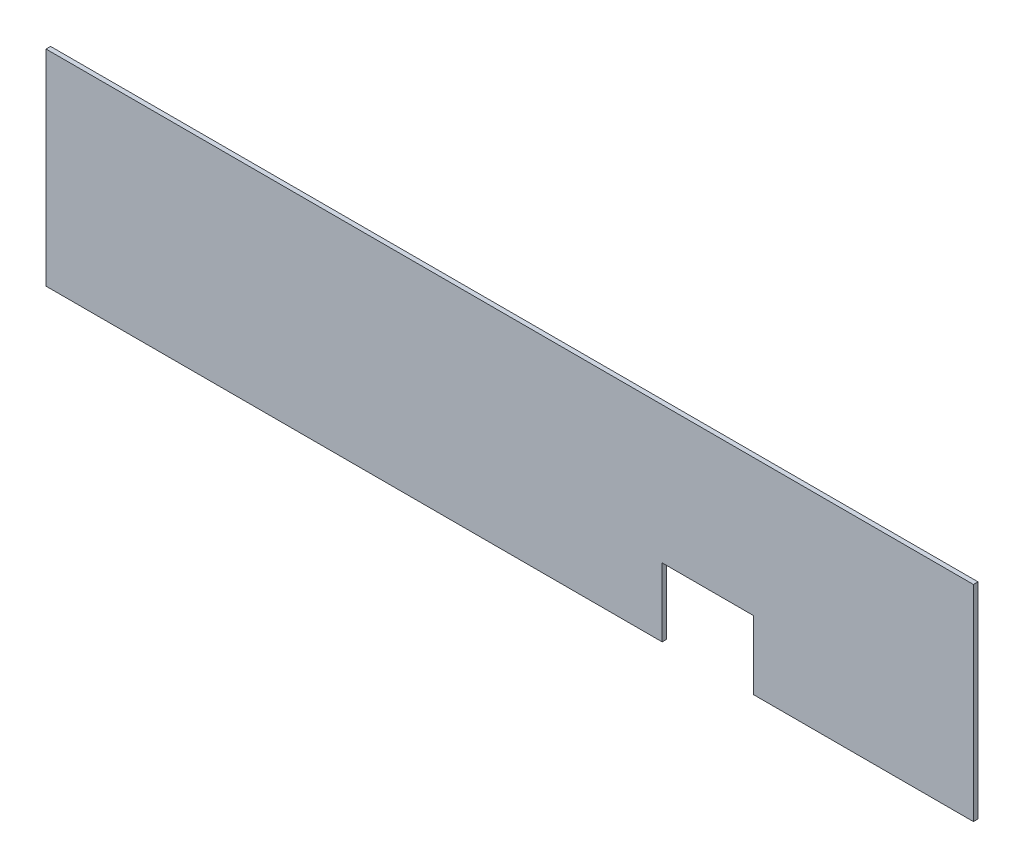
ISO-10303-21;
HEADER;
FILE_DESCRIPTION(('STEP AP214'),'2;1');
FILE_NAME('part.step','',(''),(''),'','','');
FILE_SCHEMA(('AUTOMOTIVE_DESIGN { 1 0 10303 214 1 1 1 1 }'));
ENDSEC;
DATA;
#1=APPLICATION_CONTEXT('core data for automotive mechanical design processes');
#2=APPLICATION_PROTOCOL_DEFINITION('international standard','automotive_design',2000,#1);
#3=PRODUCT_CONTEXT('',#1,'mechanical');
#4=PRODUCT('Part','Part','',(#3));
#5=PRODUCT_RELATED_PRODUCT_CATEGORY('part','',(#4));
#6=PRODUCT_DEFINITION_FORMATION('','',#4);
#7=PRODUCT_DEFINITION_CONTEXT('part definition',#1,'design');
#8=PRODUCT_DEFINITION('design','',#6,#7);
#9=PRODUCT_DEFINITION_SHAPE('','',#8);
#10=(LENGTH_UNIT() NAMED_UNIT(*) SI_UNIT(.MILLI.,.METRE.));
#11=(NAMED_UNIT(*) PLANE_ANGLE_UNIT() SI_UNIT($,.RADIAN.));
#12=(NAMED_UNIT(*) SI_UNIT($,.STERADIAN.) SOLID_ANGLE_UNIT());
#13=UNCERTAINTY_MEASURE_WITH_UNIT(LENGTH_MEASURE(1.E-05),#10,'distance_accuracy_value','');
#14=(GEOMETRIC_REPRESENTATION_CONTEXT(3) GLOBAL_UNCERTAINTY_ASSIGNED_CONTEXT((#13)) GLOBAL_UNIT_ASSIGNED_CONTEXT((#10,
#11,#12)) REPRESENTATION_CONTEXT('',''));
#15=CARTESIAN_POINT('',(0.,0.,0.));
#16=DIRECTION('',(0.,0.,1.));
#17=DIRECTION('',(1.,0.,0.));
#18=AXIS2_PLACEMENT_3D('',#15,#16,#17);
#19=CARTESIAN_POINT('',(101.6,-22.5,1.));
#20=DIRECTION('',(0.,1.,0.));
#21=DIRECTION('',(-1.,0.,0.));
#22=AXIS2_PLACEMENT_3D('',#19,#20,#21);
#23=PLANE('',#22);
#24=DIRECTION('',(1.,0.,0.));
#25=VECTOR('',#24,1.);
#26=CARTESIAN_POINT('',(101.6,-22.5,0.));
#27=LINE('',#26,#25);
#28=CARTESIAN_POINT('',(-101.6,-22.5,0.));
#29=VERTEX_POINT('',#28);
#30=CARTESIAN_POINT('',(33.4,-22.5,0.));
#31=VERTEX_POINT('',#30);
#32=EDGE_CURVE('E130',#29,#31,#27,.T.);
#33=ORIENTED_EDGE('',*,*,#32,.T.);
#34=DIRECTION('',(0.,0.,1.));
#35=VECTOR('',#34,1.);
#36=CARTESIAN_POINT('',(33.4,-22.5,0.));
#37=LINE('',#36,#35);
#38=CARTESIAN_POINT('',(33.4,-22.5,1.));
#39=VERTEX_POINT('',#38);
#40=EDGE_CURVE('E135',#31,#39,#37,.T.);
#41=ORIENTED_EDGE('',*,*,#40,.T.);
#42=DIRECTION('',(1.,0.,0.));
#43=VECTOR('',#42,1.);
#44=CARTESIAN_POINT('',(101.6,-22.5,1.));
#45=LINE('',#44,#43);
#46=CARTESIAN_POINT('',(-101.6,-22.5,1.));
#47=VERTEX_POINT('',#46);
#48=EDGE_CURVE('E85',#47,#39,#45,.T.);
#49=ORIENTED_EDGE('',*,*,#48,.F.);
#50=DIRECTION('',(0.,0.,-1.));
#51=VECTOR('',#50,1.);
#52=CARTESIAN_POINT('',(-101.6,-22.5,1.));
#53=LINE('',#52,#51);
#54=EDGE_CURVE('E11',#47,#29,#53,.T.);
#55=ORIENTED_EDGE('',*,*,#54,.T.);
#56=EDGE_LOOP('',(#33,#41,#49,#55));
#57=FACE_BOUND('',#56,.T.);
#58=ADVANCED_FACE('F33',(#57),#23,.F.);
#59=CARTESIAN_POINT('',(-101.6,-22.5,1.));
#60=DIRECTION('',(1.,0.,0.));
#61=DIRECTION('',(0.,0.,-1.));
#62=AXIS2_PLACEMENT_3D('',#59,#60,#61);
#63=PLANE('',#62);
#64=DIRECTION('',(0.,-1.,0.));
#65=VECTOR('',#64,1.);
#66=CARTESIAN_POINT('',(-101.6,-22.5,0.));
#67=LINE('',#66,#65);
#68=CARTESIAN_POINT('',(-101.6,22.5,0.));
#69=VERTEX_POINT('',#68);
#70=EDGE_CURVE('E131',#69,#29,#67,.T.);
#71=ORIENTED_EDGE('',*,*,#70,.T.);
#72=ORIENTED_EDGE('',*,*,#54,.F.);
#73=DIRECTION('',(0.,-1.,0.));
#74=VECTOR('',#73,1.);
#75=CARTESIAN_POINT('',(-101.6,-22.5,1.));
#76=LINE('',#75,#74);
#77=CARTESIAN_POINT('',(-101.6,22.5,1.));
#78=VERTEX_POINT('',#77);
#79=EDGE_CURVE('E141',#78,#47,#76,.T.);
#80=ORIENTED_EDGE('',*,*,#79,.F.);
#81=DIRECTION('',(0.,0.,-1.));
#82=VECTOR('',#81,1.);
#83=CARTESIAN_POINT('',(-101.6,22.5,1.));
#84=LINE('',#83,#82);
#85=EDGE_CURVE('E142',#78,#69,#84,.T.);
#86=ORIENTED_EDGE('',*,*,#85,.T.);
#87=EDGE_LOOP('',(#71,#72,#80,#86));
#88=FACE_BOUND('',#87,.T.);
#89=ADVANCED_FACE('F35',(#88),#63,.F.);
#90=CARTESIAN_POINT('',(53.4,-22.5,1.));
#91=VERTEX_POINT('',#90);
#92=CARTESIAN_POINT('',(101.6,-22.5,1.));
#93=VERTEX_POINT('',#92);
#94=EDGE_CURVE('E124',#91,#93,#45,.T.);
#95=ORIENTED_EDGE('',*,*,#94,.F.);
#96=DIRECTION('',(0.,0.,1.));
#97=VECTOR('',#96,1.);
#98=CARTESIAN_POINT('',(53.4,-22.5,0.));
#99=LINE('',#98,#97);
#100=CARTESIAN_POINT('',(53.4,-22.5,0.));
#101=VERTEX_POINT('',#100);
#102=EDGE_CURVE('E111',#101,#91,#99,.T.);
#103=ORIENTED_EDGE('',*,*,#102,.F.);
#104=CARTESIAN_POINT('',(101.6,-22.5,0.));
#105=VERTEX_POINT('',#104);
#106=EDGE_CURVE('E122',#101,#105,#27,.T.);
#107=ORIENTED_EDGE('',*,*,#106,.T.);
#108=DIRECTION('',(0.,0.,-1.));
#109=VECTOR('',#108,1.);
#110=CARTESIAN_POINT('',(101.6,-22.5,1.));
#111=LINE('',#110,#109);
#112=EDGE_CURVE('E41',#93,#105,#111,.T.);
#113=ORIENTED_EDGE('',*,*,#112,.F.);
#114=EDGE_LOOP('',(#95,#103,#107,#113));
#115=FACE_BOUND('',#114,.T.);
#116=ADVANCED_FACE('F120',(#115),#23,.F.);
#117=CARTESIAN_POINT('',(101.6,-22.5,1.));
#118=DIRECTION('',(-1.,0.,0.));
#119=DIRECTION('',(0.,0.,1.));
#120=AXIS2_PLACEMENT_3D('',#117,#118,#119);
#121=PLANE('',#120);
#122=DIRECTION('',(0.,1.,0.));
#123=VECTOR('',#122,1.);
#124=CARTESIAN_POINT('',(101.6,-22.5,0.));
#125=LINE('',#124,#123);
#126=CARTESIAN_POINT('',(101.6,22.5,0.));
#127=VERTEX_POINT('',#126);
#128=EDGE_CURVE('E129',#105,#127,#125,.T.);
#129=ORIENTED_EDGE('',*,*,#128,.T.);
#130=DIRECTION('',(0.,0.,-1.));
#131=VECTOR('',#130,1.);
#132=CARTESIAN_POINT('',(101.6,22.5,1.));
#133=LINE('',#132,#131);
#134=CARTESIAN_POINT('',(101.6,22.5,1.));
#135=VERTEX_POINT('',#134);
#136=EDGE_CURVE('E144',#135,#127,#133,.T.);
#137=ORIENTED_EDGE('',*,*,#136,.F.);
#138=DIRECTION('',(0.,1.,0.));
#139=VECTOR('',#138,1.);
#140=CARTESIAN_POINT('',(101.6,-22.5,1.));
#141=LINE('',#140,#139);
#142=EDGE_CURVE('E149',#93,#135,#141,.T.);
#143=ORIENTED_EDGE('',*,*,#142,.F.);
#144=ORIENTED_EDGE('',*,*,#112,.T.);
#145=EDGE_LOOP('',(#129,#137,#143,#144));
#146=FACE_BOUND('',#145,.T.);
#147=ADVANCED_FACE('F147',(#146),#121,.F.);
#148=CARTESIAN_POINT('',(101.6,22.5,1.));
#149=DIRECTION('',(0.,-1.,0.));
#150=DIRECTION('',(1.,0.,0.));
#151=AXIS2_PLACEMENT_3D('',#148,#149,#150);
#152=PLANE('',#151);
#153=DIRECTION('',(-1.,0.,0.));
#154=VECTOR('',#153,1.);
#155=CARTESIAN_POINT('',(101.6,22.5,0.));
#156=LINE('',#155,#154);
#157=EDGE_CURVE('E78',#127,#69,#156,.T.);
#158=ORIENTED_EDGE('',*,*,#157,.T.);
#159=ORIENTED_EDGE('',*,*,#85,.F.);
#160=DIRECTION('',(-1.,0.,0.));
#161=VECTOR('',#160,1.);
#162=CARTESIAN_POINT('',(101.6,22.5,1.));
#163=LINE('',#162,#161);
#164=EDGE_CURVE('E57',#135,#78,#163,.T.);
#165=ORIENTED_EDGE('',*,*,#164,.F.);
#166=ORIENTED_EDGE('',*,*,#136,.T.);
#167=EDGE_LOOP('',(#158,#159,#165,#166));
#168=FACE_BOUND('',#167,.T.);
#169=ADVANCED_FACE('F172',(#168),#152,.F.);
#170=CARTESIAN_POINT('',(0.,0.,1.));
#171=DIRECTION('',(0.,0.,1.));
#172=DIRECTION('',(1.,0.,0.));
#173=AXIS2_PLACEMENT_3D('',#170,#171,#172);
#174=PLANE('',#173);
#175=DIRECTION('',(0.,-1.,0.));
#176=VECTOR('',#175,1.);
#177=CARTESIAN_POINT('',(33.4,-22.5,1.));
#178=LINE('',#177,#176);
#179=CARTESIAN_POINT('',(33.4,-7.50000000000002,1.));
#180=VERTEX_POINT('',#179);
#181=EDGE_CURVE('E116',#180,#39,#178,.T.);
#182=ORIENTED_EDGE('',*,*,#181,.F.);
#183=DIRECTION('',(-1.,0.,0.));
#184=VECTOR('',#183,1.);
#185=CARTESIAN_POINT('',(33.4,-7.50000000000002,1.));
#186=LINE('',#185,#184);
#187=CARTESIAN_POINT('',(53.4,-7.50000000000002,1.));
#188=VERTEX_POINT('',#187);
#189=EDGE_CURVE('E159',#188,#180,#186,.T.);
#190=ORIENTED_EDGE('',*,*,#189,.F.);
#191=DIRECTION('',(0.,1.,0.));
#192=VECTOR('',#191,1.);
#193=CARTESIAN_POINT('',(53.4,-7.50000000000002,1.));
#194=LINE('',#193,#192);
#195=EDGE_CURVE('E162',#91,#188,#194,.T.);
#196=ORIENTED_EDGE('',*,*,#195,.F.);
#197=ORIENTED_EDGE('',*,*,#94,.T.);
#198=ORIENTED_EDGE('',*,*,#142,.T.);
#199=ORIENTED_EDGE('',*,*,#164,.T.);
#200=ORIENTED_EDGE('',*,*,#79,.T.);
#201=ORIENTED_EDGE('',*,*,#48,.T.);
#202=EDGE_LOOP('',(#182,#190,#196,#197,#198,#199,#200,#201));
#203=FACE_BOUND('',#202,.T.);
#204=ADVANCED_FACE('F174',(#203),#174,.T.);
#205=CARTESIAN_POINT('',(0.,0.,0.));
#206=DIRECTION('',(0.,0.,1.));
#207=DIRECTION('',(1.,0.,0.));
#208=AXIS2_PLACEMENT_3D('',#205,#206,#207);
#209=PLANE('',#208);
#210=DIRECTION('',(-1.,0.,0.));
#211=VECTOR('',#210,1.);
#212=CARTESIAN_POINT('',(33.4,-7.50000000000002,0.));
#213=LINE('',#212,#211);
#214=CARTESIAN_POINT('',(53.4,-7.50000000000002,0.));
#215=VERTEX_POINT('',#214);
#216=CARTESIAN_POINT('',(33.4,-7.50000000000002,0.));
#217=VERTEX_POINT('',#216);
#218=EDGE_CURVE('E48',#215,#217,#213,.T.);
#219=ORIENTED_EDGE('',*,*,#218,.T.);
#220=DIRECTION('',(0.,-1.,0.));
#221=VECTOR('',#220,1.);
#222=CARTESIAN_POINT('',(33.4,-22.5,0.));
#223=LINE('',#222,#221);
#224=EDGE_CURVE('E125',#217,#31,#223,.T.);
#225=ORIENTED_EDGE('',*,*,#224,.T.);
#226=ORIENTED_EDGE('',*,*,#32,.F.);
#227=ORIENTED_EDGE('',*,*,#70,.F.);
#228=ORIENTED_EDGE('',*,*,#157,.F.);
#229=ORIENTED_EDGE('',*,*,#128,.F.);
#230=ORIENTED_EDGE('',*,*,#106,.F.);
#231=DIRECTION('',(0.,1.,0.));
#232=VECTOR('',#231,1.);
#233=CARTESIAN_POINT('',(53.4,-7.50000000000002,0.));
#234=LINE('',#233,#232);
#235=EDGE_CURVE('E107',#101,#215,#234,.T.);
#236=ORIENTED_EDGE('',*,*,#235,.T.);
#237=EDGE_LOOP('',(#219,#225,#226,#227,#228,#229,#230,#236));
#238=FACE_BOUND('',#237,.T.);
#239=ADVANCED_FACE('F128',(#238),#209,.F.);
#240=CARTESIAN_POINT('',(33.4,-22.5,0.));
#241=DIRECTION('',(-1.,0.,0.));
#242=DIRECTION('',(0.,0.,1.));
#243=AXIS2_PLACEMENT_3D('',#240,#241,#242);
#244=PLANE('',#243);
#245=ORIENTED_EDGE('',*,*,#181,.T.);
#246=ORIENTED_EDGE('',*,*,#40,.F.);
#247=ORIENTED_EDGE('',*,*,#224,.F.);
#248=DIRECTION('',(0.,0.,1.));
#249=VECTOR('',#248,1.);
#250=CARTESIAN_POINT('',(33.4,-7.50000000000002,0.));
#251=LINE('',#250,#249);
#252=EDGE_CURVE('E155',#217,#180,#251,.T.);
#253=ORIENTED_EDGE('',*,*,#252,.T.);
#254=EDGE_LOOP('',(#245,#246,#247,#253));
#255=FACE_BOUND('',#254,.T.);
#256=ADVANCED_FACE('F217',(#255),#244,.F.);
#257=CARTESIAN_POINT('',(33.4,-7.50000000000002,0.));
#258=DIRECTION('',(0.,1.,0.));
#259=DIRECTION('',(0.,0.,1.));
#260=AXIS2_PLACEMENT_3D('',#257,#258,#259);
#261=PLANE('',#260);
#262=ORIENTED_EDGE('',*,*,#189,.T.);
#263=ORIENTED_EDGE('',*,*,#252,.F.);
#264=ORIENTED_EDGE('',*,*,#218,.F.);
#265=DIRECTION('',(0.,0.,1.));
#266=VECTOR('',#265,1.);
#267=CARTESIAN_POINT('',(53.4,-7.50000000000002,0.));
#268=LINE('',#267,#266);
#269=EDGE_CURVE('E113',#215,#188,#268,.T.);
#270=ORIENTED_EDGE('',*,*,#269,.T.);
#271=EDGE_LOOP('',(#262,#263,#264,#270));
#272=FACE_BOUND('',#271,.T.);
#273=ADVANCED_FACE('F223',(#272),#261,.F.);
#274=CARTESIAN_POINT('',(53.4,-7.50000000000002,0.));
#275=DIRECTION('',(1.,0.,0.));
#276=DIRECTION('',(0.,0.,-1.));
#277=AXIS2_PLACEMENT_3D('',#274,#275,#276);
#278=PLANE('',#277);
#279=ORIENTED_EDGE('',*,*,#195,.T.);
#280=ORIENTED_EDGE('',*,*,#269,.F.);
#281=ORIENTED_EDGE('',*,*,#235,.F.);
#282=ORIENTED_EDGE('',*,*,#102,.T.);
#283=EDGE_LOOP('',(#279,#280,#281,#282));
#284=FACE_BOUND('',#283,.T.);
#285=ADVANCED_FACE('F110',(#284),#278,.F.);
#286=CLOSED_SHELL('',(#58,#89,#116,#147,#169,#204,#239,#256,#273,#285));
#287=MANIFOLD_SOLID_BREP('B2',#286);
#288=ADVANCED_BREP_SHAPE_REPRESENTATION('',(#18,#287),#14);
#289=SHAPE_DEFINITION_REPRESENTATION(#9,#288);
ENDSEC;
END-ISO-10303-21;
